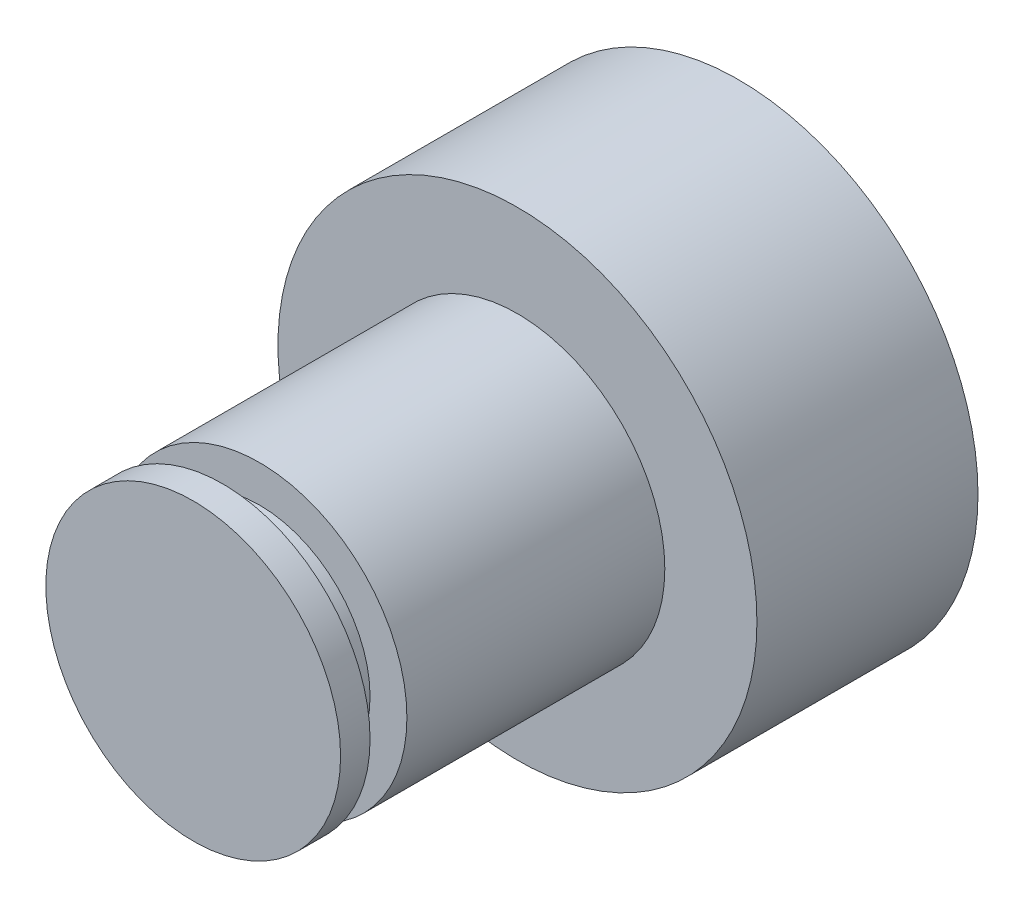
ISO-10303-21;
HEADER;
FILE_DESCRIPTION(('STEP AP214'),'2;1');
FILE_NAME('part.step','',(''),(''),'','','');
FILE_SCHEMA(('AUTOMOTIVE_DESIGN { 1 0 10303 214 1 1 1 1 }'));
ENDSEC;
DATA;
#1=APPLICATION_CONTEXT('core data for automotive mechanical design processes');
#2=APPLICATION_PROTOCOL_DEFINITION('international standard','automotive_design',2000,#1);
#3=PRODUCT_CONTEXT('',#1,'mechanical');
#4=PRODUCT('Part','Part','',(#3));
#5=PRODUCT_RELATED_PRODUCT_CATEGORY('part','',(#4));
#6=PRODUCT_DEFINITION_FORMATION('','',#4);
#7=PRODUCT_DEFINITION_CONTEXT('part definition',#1,'design');
#8=PRODUCT_DEFINITION('design','',#6,#7);
#9=PRODUCT_DEFINITION_SHAPE('','',#8);
#10=(LENGTH_UNIT() NAMED_UNIT(*) SI_UNIT(.MILLI.,.METRE.));
#11=(NAMED_UNIT(*) PLANE_ANGLE_UNIT() SI_UNIT($,.RADIAN.));
#12=(NAMED_UNIT(*) SI_UNIT($,.STERADIAN.) SOLID_ANGLE_UNIT());
#13=UNCERTAINTY_MEASURE_WITH_UNIT(LENGTH_MEASURE(1.E-05),#10,'distance_accuracy_value','');
#14=(GEOMETRIC_REPRESENTATION_CONTEXT(3) GLOBAL_UNCERTAINTY_ASSIGNED_CONTEXT((#13)) GLOBAL_UNIT_ASSIGNED_CONTEXT((#10,
#11,#12)) REPRESENTATION_CONTEXT('',''));
#15=CARTESIAN_POINT('',(0.,0.,0.));
#16=DIRECTION('',(0.,0.,1.));
#17=DIRECTION('',(1.,0.,0.));
#18=AXIS2_PLACEMENT_3D('',#15,#16,#17);
#19=CARTESIAN_POINT('',(0.,0.,8.8));
#20=DIRECTION('',(0.,0.,-1.));
#21=DIRECTION('',(-1.,0.,0.));
#22=AXIS2_PLACEMENT_3D('',#19,#20,#21);
#23=CYLINDRICAL_SURFACE('',#22,4.);
#24=CARTESIAN_POINT('',(0.,0.,0.));
#25=DIRECTION('',(0.,0.,1.));
#26=DIRECTION('',(1.,0.,0.));
#27=AXIS2_PLACEMENT_3D('',#24,#25,#26);
#28=CIRCLE('',#27,4.);
#29=CARTESIAN_POINT('',(4.,0.,0.));
#30=VERTEX_POINT('',#29);
#31=EDGE_CURVE('E44',#30,#30,#28,.T.);
#32=ORIENTED_EDGE('',*,*,#31,.T.);
#33=EDGE_LOOP('',(#32));
#34=FACE_BOUND('',#33,.T.);
#35=CARTESIAN_POINT('',(0.,0.,7.));
#36=DIRECTION('',(0.,0.,1.));
#37=DIRECTION('',(1.,0.,0.));
#38=AXIS2_PLACEMENT_3D('',#35,#36,#37);
#39=CIRCLE('',#38,4.);
#40=CARTESIAN_POINT('',(4.,0.,7.));
#41=VERTEX_POINT('',#40);
#42=EDGE_CURVE('E47',#41,#41,#39,.T.);
#43=ORIENTED_EDGE('',*,*,#42,.F.);
#44=EDGE_LOOP('',(#43));
#45=FACE_BOUND('',#44,.T.);
#46=ADVANCED_FACE('F31',(#34,#45),#23,.T.);
#47=CARTESIAN_POINT('',(0.,0.,-6.));
#48=DIRECTION('',(0.,0.,1.));
#49=DIRECTION('',(1.,0.,0.));
#50=AXIS2_PLACEMENT_3D('',#47,#48,#49);
#51=CYLINDRICAL_SURFACE('',#50,6.5);
#52=CARTESIAN_POINT('',(0.,0.,-6.));
#53=DIRECTION('',(0.,0.,1.));
#54=DIRECTION('',(1.,0.,0.));
#55=AXIS2_PLACEMENT_3D('',#52,#53,#54);
#56=CIRCLE('',#55,6.5);
#57=CARTESIAN_POINT('',(6.5,0.,-6.));
#58=VERTEX_POINT('',#57);
#59=EDGE_CURVE('E10',#58,#58,#56,.T.);
#60=ORIENTED_EDGE('',*,*,#59,.T.);
#61=EDGE_LOOP('',(#60));
#62=FACE_BOUND('',#61,.T.);
#63=CARTESIAN_POINT('',(0.,0.,0.));
#64=DIRECTION('',(0.,0.,1.));
#65=DIRECTION('',(1.,0.,0.));
#66=AXIS2_PLACEMENT_3D('',#63,#64,#65);
#67=CIRCLE('',#66,6.5);
#68=CARTESIAN_POINT('',(6.5,0.,0.));
#69=VERTEX_POINT('',#68);
#70=EDGE_CURVE('E35',#69,#69,#67,.T.);
#71=ORIENTED_EDGE('',*,*,#70,.F.);
#72=EDGE_LOOP('',(#71));
#73=FACE_BOUND('',#72,.T.);
#74=ADVANCED_FACE('F33',(#62,#73),#51,.T.);
#75=CARTESIAN_POINT('',(0.,0.,-6.));
#76=DIRECTION('',(0.,0.,1.));
#77=DIRECTION('',(1.,0.,0.));
#78=AXIS2_PLACEMENT_3D('',#75,#76,#77);
#79=PLANE('',#78);
#80=ORIENTED_EDGE('',*,*,#59,.F.);
#81=EDGE_LOOP('',(#80));
#82=FACE_BOUND('',#81,.T.);
#83=ADVANCED_FACE('F80',(#82),#79,.F.);
#84=CARTESIAN_POINT('',(0.,0.,0.));
#85=DIRECTION('',(0.,0.,1.));
#86=DIRECTION('',(1.,0.,0.));
#87=AXIS2_PLACEMENT_3D('',#84,#85,#86);
#88=PLANE('',#87);
#89=ORIENTED_EDGE('',*,*,#31,.F.);
#90=EDGE_LOOP('',(#89));
#91=FACE_BOUND('',#90,.T.);
#92=ORIENTED_EDGE('',*,*,#70,.T.);
#93=EDGE_LOOP('',(#92));
#94=FACE_BOUND('',#93,.T.);
#95=ADVANCED_FACE('F69',(#91,#94),#88,.T.);
#96=CARTESIAN_POINT('',(0.,0.,7.));
#97=DIRECTION('',(0.,0.,1.));
#98=DIRECTION('',(1.,0.,0.));
#99=AXIS2_PLACEMENT_3D('',#96,#97,#98);
#100=PLANE('',#99);
#101=CARTESIAN_POINT('',(0.,0.,7.));
#102=DIRECTION('',(0.,0.,1.));
#103=DIRECTION('',(1.,0.,0.));
#104=AXIS2_PLACEMENT_3D('',#101,#102,#103);
#105=CIRCLE('',#104,3.);
#106=CARTESIAN_POINT('',(3.,0.,7.));
#107=VERTEX_POINT('',#106);
#108=EDGE_CURVE('E53',#107,#107,#105,.T.);
#109=ORIENTED_EDGE('',*,*,#108,.F.);
#110=EDGE_LOOP('',(#109));
#111=FACE_BOUND('',#110,.T.);
#112=ORIENTED_EDGE('',*,*,#42,.T.);
#113=EDGE_LOOP('',(#112));
#114=FACE_BOUND('',#113,.T.);
#115=ADVANCED_FACE('F65',(#111,#114),#100,.T.);
#116=CARTESIAN_POINT('',(0.,0.,8.));
#117=DIRECTION('',(0.,0.,1.));
#118=DIRECTION('',(1.,0.,0.));
#119=AXIS2_PLACEMENT_3D('',#116,#117,#118);
#120=PLANE('',#119);
#121=CARTESIAN_POINT('',(0.,0.,8.));
#122=DIRECTION('',(0.,0.,1.));
#123=DIRECTION('',(1.,0.,0.));
#124=AXIS2_PLACEMENT_3D('',#121,#122,#123);
#125=CIRCLE('',#124,3.);
#126=CARTESIAN_POINT('',(3.,0.,8.));
#127=VERTEX_POINT('',#126);
#128=EDGE_CURVE('E56',#127,#127,#125,.T.);
#129=ORIENTED_EDGE('',*,*,#128,.T.);
#130=EDGE_LOOP('',(#129));
#131=FACE_BOUND('',#130,.T.);
#132=CARTESIAN_POINT('',(0.,0.,8.));
#133=DIRECTION('',(0.,0.,1.));
#134=DIRECTION('',(1.,0.,0.));
#135=AXIS2_PLACEMENT_3D('',#132,#133,#134);
#136=CIRCLE('',#135,4.);
#137=CARTESIAN_POINT('',(4.,0.,8.));
#138=VERTEX_POINT('',#137);
#139=EDGE_CURVE('E50',#138,#138,#136,.T.);
#140=ORIENTED_EDGE('',*,*,#139,.F.);
#141=EDGE_LOOP('',(#140));
#142=FACE_BOUND('',#141,.T.);
#143=ADVANCED_FACE('F68',(#131,#142),#120,.F.);
#144=CARTESIAN_POINT('',(0.,0.,7.));
#145=DIRECTION('',(0.,0.,1.));
#146=DIRECTION('',(1.,0.,0.));
#147=AXIS2_PLACEMENT_3D('',#144,#145,#146);
#148=CYLINDRICAL_SURFACE('',#147,3.);
#149=ORIENTED_EDGE('',*,*,#108,.T.);
#150=EDGE_LOOP('',(#149));
#151=FACE_BOUND('',#150,.T.);
#152=ORIENTED_EDGE('',*,*,#128,.F.);
#153=EDGE_LOOP('',(#152));
#154=FACE_BOUND('',#153,.T.);
#155=ADVANCED_FACE('F62',(#151,#154),#148,.T.);
#156=CARTESIAN_POINT('',(0.,0.,8.8));
#157=DIRECTION('',(0.,0.,1.));
#158=DIRECTION('',(1.,0.,0.));
#159=AXIS2_PLACEMENT_3D('',#156,#157,#158);
#160=PLANE('',#159);
#161=CARTESIAN_POINT('',(0.,0.,8.8));
#162=DIRECTION('',(0.,0.,1.));
#163=DIRECTION('',(1.,0.,0.));
#164=AXIS2_PLACEMENT_3D('',#161,#162,#163);
#165=CIRCLE('',#164,4.);
#166=CARTESIAN_POINT('',(4.,0.,8.8));
#167=VERTEX_POINT('',#166);
#168=EDGE_CURVE('E42',#167,#167,#165,.T.);
#169=ORIENTED_EDGE('',*,*,#168,.T.);
#170=EDGE_LOOP('',(#169));
#171=FACE_BOUND('',#170,.T.);
#172=ADVANCED_FACE('F84',(#171),#160,.T.);
#173=ORIENTED_EDGE('',*,*,#139,.T.);
#174=EDGE_LOOP('',(#173));
#175=FACE_BOUND('',#174,.T.);
#176=ORIENTED_EDGE('',*,*,#168,.F.);
#177=EDGE_LOOP('',(#176));
#178=FACE_BOUND('',#177,.T.);
#179=ADVANCED_FACE('F76',(#175,#178),#23,.T.);
#180=CLOSED_SHELL('',(#46,#74,#83,#95,#115,#143,#155,#172,#179));
#181=MANIFOLD_SOLID_BREP('B2',#180);
#182=ADVANCED_BREP_SHAPE_REPRESENTATION('',(#18,#181),#14);
#183=SHAPE_DEFINITION_REPRESENTATION(#9,#182);
ENDSEC;
END-ISO-10303-21;
